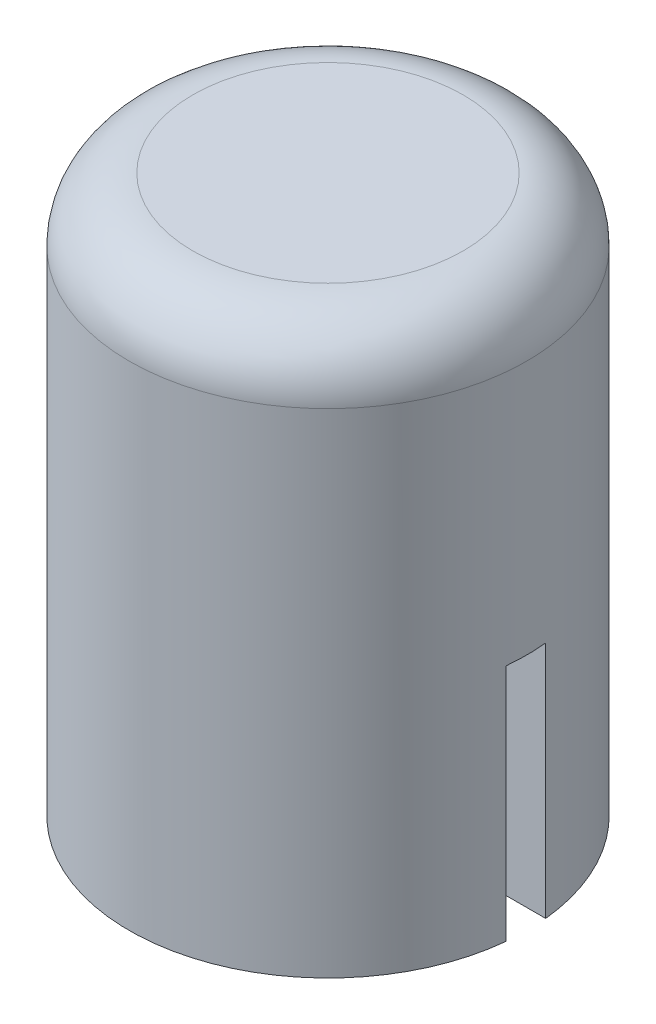
ISO-10303-21;
HEADER;
FILE_DESCRIPTION(('STEP AP214'),'2;1');
FILE_NAME('part.step','',(''),(''),'','','');
FILE_SCHEMA(('AUTOMOTIVE_DESIGN { 1 0 10303 214 1 1 1 1 }'));
ENDSEC;
DATA;
#1=APPLICATION_CONTEXT('core data for automotive mechanical design processes');
#2=APPLICATION_PROTOCOL_DEFINITION('international standard','automotive_design',2000,#1);
#3=PRODUCT_CONTEXT('',#1,'mechanical');
#4=PRODUCT('Part','Part','',(#3));
#5=PRODUCT_RELATED_PRODUCT_CATEGORY('part','',(#4));
#6=PRODUCT_DEFINITION_FORMATION('','',#4);
#7=PRODUCT_DEFINITION_CONTEXT('part definition',#1,'design');
#8=PRODUCT_DEFINITION('design','',#6,#7);
#9=PRODUCT_DEFINITION_SHAPE('','',#8);
#10=(LENGTH_UNIT() NAMED_UNIT(*) SI_UNIT(.MILLI.,.METRE.));
#11=(NAMED_UNIT(*) PLANE_ANGLE_UNIT() SI_UNIT($,.RADIAN.));
#12=(NAMED_UNIT(*) SI_UNIT($,.STERADIAN.) SOLID_ANGLE_UNIT());
#13=UNCERTAINTY_MEASURE_WITH_UNIT(LENGTH_MEASURE(1.E-05),#10,'distance_accuracy_value','');
#14=(GEOMETRIC_REPRESENTATION_CONTEXT(3) GLOBAL_UNCERTAINTY_ASSIGNED_CONTEXT((#13)) GLOBAL_UNIT_ASSIGNED_CONTEXT((#10,
#11,#12)) REPRESENTATION_CONTEXT('',''));
#15=CARTESIAN_POINT('',(0.,0.,0.));
#16=DIRECTION('',(0.,0.,1.));
#17=DIRECTION('',(1.,0.,0.));
#18=AXIS2_PLACEMENT_3D('',#15,#16,#17);
#19=CARTESIAN_POINT('',(0.,6.2,0.));
#20=DIRECTION('',(0.,1.,0.));
#21=DIRECTION('',(0.,0.,-1.));
#22=AXIS2_PLACEMENT_3D('',#19,#20,#21);
#23=TOROIDAL_SURFACE('',#22,1.7,0.8);
#24=CARTESIAN_POINT('',(0.,7.,0.));
#25=DIRECTION('',(0.,1.,0.));
#26=DIRECTION('',(0.,0.,-1.));
#27=AXIS2_PLACEMENT_3D('',#24,#25,#26);
#28=CIRCLE('',#27,1.7);
#29=CARTESIAN_POINT('',(0.,7.,-1.7));
#30=VERTEX_POINT('',#29);
#31=EDGE_CURVE('E11',#30,#30,#28,.T.);
#32=ORIENTED_EDGE('',*,*,#31,.F.);
#33=EDGE_LOOP('',(#32));
#34=FACE_BOUND('',#33,.T.);
#35=CARTESIAN_POINT('',(0.,6.2,0.));
#36=DIRECTION('',(0.,1.,0.));
#37=DIRECTION('',(0.,0.,-1.));
#38=AXIS2_PLACEMENT_3D('',#35,#36,#37);
#39=CIRCLE('',#38,2.5);
#40=CARTESIAN_POINT('',(0.,6.2,-2.5));
#41=VERTEX_POINT('',#40);
#42=EDGE_CURVE('E286',#41,#41,#39,.T.);
#43=ORIENTED_EDGE('',*,*,#42,.T.);
#44=EDGE_LOOP('',(#43));
#45=FACE_BOUND('',#44,.T.);
#46=ADVANCED_FACE('F17',(#34,#45),#23,.T.);
#47=CARTESIAN_POINT('',(0.,7.,0.));
#48=DIRECTION('',(0.,1.,0.));
#49=DIRECTION('',(1.,0.,0.));
#50=AXIS2_PLACEMENT_3D('',#47,#48,#49);
#51=PLANE('',#50);
#52=ORIENTED_EDGE('',*,*,#31,.T.);
#53=EDGE_LOOP('',(#52));
#54=FACE_BOUND('',#53,.T.);
#55=ADVANCED_FACE('F307',(#54),#51,.T.);
#56=CARTESIAN_POINT('',(-2.5,3.,-0.25));
#57=DIRECTION('',(0.,0.,-1.));
#58=DIRECTION('',(0.,-1.,0.));
#59=AXIS2_PLACEMENT_3D('',#56,#57,#58);
#60=PLANE('',#59);
#61=DIRECTION('',(1.,0.,0.));
#62=VECTOR('',#61,1.);
#63=CARTESIAN_POINT('',(1.35,3.,-0.25));
#64=LINE('',#63,#62);
#65=CARTESIAN_POINT('',(1.35,3.,-0.25));
#66=VERTEX_POINT('',#65);
#67=CARTESIAN_POINT('',(2.48746859276655,3.,-0.25));
#68=VERTEX_POINT('',#67);
#69=EDGE_CURVE('E26',#66,#68,#64,.T.);
#70=ORIENTED_EDGE('',*,*,#69,.F.);
#71=DIRECTION('',(0.,1.,0.));
#72=VECTOR('',#71,1.);
#73=CARTESIAN_POINT('',(1.35,0.,-0.25));
#74=LINE('',#73,#72);
#75=CARTESIAN_POINT('',(1.35,0.,-0.25));
#76=VERTEX_POINT('',#75);
#77=EDGE_CURVE('E154',#76,#66,#74,.T.);
#78=ORIENTED_EDGE('',*,*,#77,.F.);
#79=DIRECTION('',(1.,0.,0.));
#80=VECTOR('',#79,1.);
#81=CARTESIAN_POINT('',(1.35,0.,-0.25));
#82=LINE('',#81,#80);
#83=CARTESIAN_POINT('',(2.48746859276655,0.,-0.25));
#84=VERTEX_POINT('',#83);
#85=EDGE_CURVE('E139',#76,#84,#82,.T.);
#86=ORIENTED_EDGE('',*,*,#85,.T.);
#87=DIRECTION('',(0.,-1.,0.));
#88=VECTOR('',#87,1.);
#89=CARTESIAN_POINT('',(2.48746859276655,3.,-0.25));
#90=LINE('',#89,#88);
#91=EDGE_CURVE('E277',#68,#84,#90,.T.);
#92=ORIENTED_EDGE('',*,*,#91,.F.);
#93=EDGE_LOOP('',(#70,#78,#86,#92));
#94=FACE_BOUND('',#93,.T.);
#95=ADVANCED_FACE('F155',(#94),#60,.F.);
#96=CARTESIAN_POINT('',(0.,3.,0.));
#97=DIRECTION('',(0.,-1.,0.));
#98=DIRECTION('',(0.,0.,-1.));
#99=AXIS2_PLACEMENT_3D('',#96,#97,#98);
#100=PLANE('',#99);
#101=CARTESIAN_POINT('',(0.,3.,0.));
#102=DIRECTION('',(0.,-1.,0.));
#103=DIRECTION('',(0.99498743710662,0.,-0.1));
#104=AXIS2_PLACEMENT_3D('',#101,#102,#103);
#105=CIRCLE('',#104,2.5);
#106=CARTESIAN_POINT('',(2.48746859276655,3.,0.25));
#107=VERTEX_POINT('',#106);
#108=EDGE_CURVE('E280',#68,#107,#105,.T.);
#109=ORIENTED_EDGE('',*,*,#108,.T.);
#110=DIRECTION('',(-1.,0.,0.));
#111=VECTOR('',#110,1.);
#112=CARTESIAN_POINT('',(2.48746859276655,3.,0.25));
#113=LINE('',#112,#111);
#114=CARTESIAN_POINT('',(1.35,3.,0.25));
#115=VERTEX_POINT('',#114);
#116=EDGE_CURVE('E181',#107,#115,#113,.T.);
#117=ORIENTED_EDGE('',*,*,#116,.T.);
#118=DIRECTION('',(0.,0.,-1.));
#119=VECTOR('',#118,1.);
#120=CARTESIAN_POINT('',(1.35,3.,0.25));
#121=LINE('',#120,#119);
#122=EDGE_CURVE('E160',#115,#66,#121,.T.);
#123=ORIENTED_EDGE('',*,*,#122,.T.);
#124=ORIENTED_EDGE('',*,*,#69,.T.);
#125=EDGE_LOOP('',(#109,#117,#123,#124));
#126=FACE_BOUND('',#125,.T.);
#127=ADVANCED_FACE('F19',(#126),#100,.T.);
#128=CARTESIAN_POINT('',(-2.5,3.,0.25));
#129=DIRECTION('',(0.,0.,1.));
#130=DIRECTION('',(1.,0.,0.));
#131=AXIS2_PLACEMENT_3D('',#128,#129,#130);
#132=PLANE('',#131);
#133=DIRECTION('',(-1.,0.,0.));
#134=VECTOR('',#133,1.);
#135=CARTESIAN_POINT('',(2.48746859276655,0.,0.25));
#136=LINE('',#135,#134);
#137=CARTESIAN_POINT('',(2.48746859276655,0.,0.25));
#138=VERTEX_POINT('',#137);
#139=CARTESIAN_POINT('',(1.35,0.,0.25));
#140=VERTEX_POINT('',#139);
#141=EDGE_CURVE('E237',#138,#140,#136,.T.);
#142=ORIENTED_EDGE('',*,*,#141,.T.);
#143=DIRECTION('',(0.,-1.,0.));
#144=VECTOR('',#143,1.);
#145=CARTESIAN_POINT('',(1.35,3.,0.25));
#146=LINE('',#145,#144);
#147=EDGE_CURVE('E178',#115,#140,#146,.T.);
#148=ORIENTED_EDGE('',*,*,#147,.F.);
#149=ORIENTED_EDGE('',*,*,#116,.F.);
#150=DIRECTION('',(0.,1.,0.));
#151=VECTOR('',#150,1.);
#152=CARTESIAN_POINT('',(2.48746859276655,0.,0.25));
#153=LINE('',#152,#151);
#154=EDGE_CURVE('E254',#138,#107,#153,.T.);
#155=ORIENTED_EDGE('',*,*,#154,.F.);
#156=EDGE_LOOP('',(#142,#148,#149,#155));
#157=FACE_BOUND('',#156,.T.);
#158=ADVANCED_FACE('F345',(#157),#132,.F.);
#159=CARTESIAN_POINT('',(0.,0.,0.));
#160=DIRECTION('',(0.,1.,0.));
#161=DIRECTION('',(1.,0.,0.));
#162=AXIS2_PLACEMENT_3D('',#159,#160,#161);
#163=PLANE('',#162);
#164=DIRECTION('',(-1.,0.,0.));
#165=VECTOR('',#164,1.);
#166=CARTESIAN_POINT('',(-1.35,0.,0.25));
#167=LINE('',#166,#165);
#168=CARTESIAN_POINT('',(-1.35,0.,0.25));
#169=VERTEX_POINT('',#168);
#170=CARTESIAN_POINT('',(-2.48746859276655,0.,0.25));
#171=VERTEX_POINT('',#170);
#172=EDGE_CURVE('E235',#169,#171,#167,.T.);
#173=ORIENTED_EDGE('',*,*,#172,.F.);
#174=DIRECTION('',(0.,0.,-1.));
#175=VECTOR('',#174,1.);
#176=CARTESIAN_POINT('',(-1.35,0.,1.35));
#177=LINE('',#176,#175);
#178=CARTESIAN_POINT('',(-1.35,0.,1.35));
#179=VERTEX_POINT('',#178);
#180=EDGE_CURVE('E214',#179,#169,#177,.T.);
#181=ORIENTED_EDGE('',*,*,#180,.F.);
#182=DIRECTION('',(-1.,0.,0.));
#183=VECTOR('',#182,1.);
#184=CARTESIAN_POINT('',(1.35,0.,1.35));
#185=LINE('',#184,#183);
#186=CARTESIAN_POINT('',(1.35,0.,1.35));
#187=VERTEX_POINT('',#186);
#188=EDGE_CURVE('E151',#187,#179,#185,.T.);
#189=ORIENTED_EDGE('',*,*,#188,.F.);
#190=DIRECTION('',(0.,0.,1.));
#191=VECTOR('',#190,1.);
#192=CARTESIAN_POINT('',(1.35,0.,0.25));
#193=LINE('',#192,#191);
#194=EDGE_CURVE('E185',#140,#187,#193,.T.);
#195=ORIENTED_EDGE('',*,*,#194,.F.);
#196=ORIENTED_EDGE('',*,*,#141,.F.);
#197=CARTESIAN_POINT('',(0.,0.,0.));
#198=DIRECTION('',(0.,1.,0.));
#199=DIRECTION('',(-0.99498743710662,0.,0.1));
#200=AXIS2_PLACEMENT_3D('',#197,#198,#199);
#201=CIRCLE('',#200,2.5);
#202=EDGE_CURVE('E258',#171,#138,#201,.T.);
#203=ORIENTED_EDGE('',*,*,#202,.F.);
#204=EDGE_LOOP('',(#173,#181,#189,#195,#196,#203));
#205=FACE_BOUND('',#204,.T.);
#206=ADVANCED_FACE('F342',(#205),#163,.F.);
#207=CARTESIAN_POINT('',(-2.5,3.,0.25));
#208=DIRECTION('',(0.,0.,1.));
#209=DIRECTION('',(1.,0.,0.));
#210=AXIS2_PLACEMENT_3D('',#207,#208,#209);
#211=PLANE('',#210);
#212=DIRECTION('',(-1.,0.,0.));
#213=VECTOR('',#212,1.);
#214=CARTESIAN_POINT('',(-1.35,3.,0.25));
#215=LINE('',#214,#213);
#216=CARTESIAN_POINT('',(-1.35,3.,0.25));
#217=VERTEX_POINT('',#216);
#218=CARTESIAN_POINT('',(-2.48746859276655,3.,0.25));
#219=VERTEX_POINT('',#218);
#220=EDGE_CURVE('E232',#217,#219,#215,.T.);
#221=ORIENTED_EDGE('',*,*,#220,.F.);
#222=DIRECTION('',(0.,1.,0.));
#223=VECTOR('',#222,1.);
#224=CARTESIAN_POINT('',(-1.35,0.,0.25));
#225=LINE('',#224,#223);
#226=EDGE_CURVE('E218',#169,#217,#225,.T.);
#227=ORIENTED_EDGE('',*,*,#226,.F.);
#228=ORIENTED_EDGE('',*,*,#172,.T.);
#229=DIRECTION('',(0.,-1.,0.));
#230=VECTOR('',#229,1.);
#231=CARTESIAN_POINT('',(-2.48746859276655,3.,0.25));
#232=LINE('',#231,#230);
#233=EDGE_CURVE('E262',#219,#171,#232,.T.);
#234=ORIENTED_EDGE('',*,*,#233,.F.);
#235=EDGE_LOOP('',(#221,#227,#228,#234));
#236=FACE_BOUND('',#235,.T.);
#237=ADVANCED_FACE('F341',(#236),#211,.F.);
#238=CARTESIAN_POINT('',(0.,3.,0.));
#239=DIRECTION('',(0.,-1.,0.));
#240=DIRECTION('',(0.,0.,-1.));
#241=AXIS2_PLACEMENT_3D('',#238,#239,#240);
#242=PLANE('',#241);
#243=CARTESIAN_POINT('',(0.,3.,0.));
#244=DIRECTION('',(0.,-1.,0.));
#245=DIRECTION('',(-0.99498743710662,0.,0.1));
#246=AXIS2_PLACEMENT_3D('',#243,#244,#245);
#247=CIRCLE('',#246,2.5);
#248=CARTESIAN_POINT('',(-2.48746859276655,3.,-0.25));
#249=VERTEX_POINT('',#248);
#250=EDGE_CURVE('E266',#219,#249,#247,.T.);
#251=ORIENTED_EDGE('',*,*,#250,.T.);
#252=DIRECTION('',(1.,0.,0.));
#253=VECTOR('',#252,1.);
#254=CARTESIAN_POINT('',(-2.48746859276655,3.,-0.25));
#255=LINE('',#254,#253);
#256=CARTESIAN_POINT('',(-1.35,3.,-0.25));
#257=VERTEX_POINT('',#256);
#258=EDGE_CURVE('E48',#249,#257,#255,.T.);
#259=ORIENTED_EDGE('',*,*,#258,.T.);
#260=DIRECTION('',(0.,0.,1.));
#261=VECTOR('',#260,1.);
#262=CARTESIAN_POINT('',(-1.35,3.,-0.25));
#263=LINE('',#262,#261);
#264=EDGE_CURVE('E199',#257,#217,#263,.T.);
#265=ORIENTED_EDGE('',*,*,#264,.T.);
#266=ORIENTED_EDGE('',*,*,#220,.T.);
#267=EDGE_LOOP('',(#251,#259,#265,#266));
#268=FACE_BOUND('',#267,.T.);
#269=ADVANCED_FACE('F333',(#268),#242,.T.);
#270=CARTESIAN_POINT('',(-2.5,3.,-0.25));
#271=DIRECTION('',(0.,0.,-1.));
#272=DIRECTION('',(0.,-1.,0.));
#273=AXIS2_PLACEMENT_3D('',#270,#271,#272);
#274=PLANE('',#273);
#275=DIRECTION('',(1.,0.,0.));
#276=VECTOR('',#275,1.);
#277=CARTESIAN_POINT('',(-2.48746859276655,0.,-0.25));
#278=LINE('',#277,#276);
#279=CARTESIAN_POINT('',(-2.48746859276655,0.,-0.25));
#280=VERTEX_POINT('',#279);
#281=CARTESIAN_POINT('',(-1.35,0.,-0.25));
#282=VERTEX_POINT('',#281);
#283=EDGE_CURVE('E38',#280,#282,#278,.T.);
#284=ORIENTED_EDGE('',*,*,#283,.T.);
#285=DIRECTION('',(0.,-1.,0.));
#286=VECTOR('',#285,1.);
#287=CARTESIAN_POINT('',(-1.35,3.,-0.25));
#288=LINE('',#287,#286);
#289=EDGE_CURVE('E194',#257,#282,#288,.T.);
#290=ORIENTED_EDGE('',*,*,#289,.F.);
#291=ORIENTED_EDGE('',*,*,#258,.F.);
#292=DIRECTION('',(0.,1.,0.));
#293=VECTOR('',#292,1.);
#294=CARTESIAN_POINT('',(-2.48746859276655,0.,-0.25));
#295=LINE('',#294,#293);
#296=EDGE_CURVE('E269',#280,#249,#295,.T.);
#297=ORIENTED_EDGE('',*,*,#296,.F.);
#298=EDGE_LOOP('',(#284,#290,#291,#297));
#299=FACE_BOUND('',#298,.T.);
#300=ADVANCED_FACE('F330',(#299),#274,.F.);
#301=CARTESIAN_POINT('',(0.,0.,0.));
#302=DIRECTION('',(0.,1.,0.));
#303=DIRECTION('',(1.,0.,0.));
#304=AXIS2_PLACEMENT_3D('',#301,#302,#303);
#305=PLANE('',#304);
#306=CARTESIAN_POINT('',(0.,0.,0.));
#307=DIRECTION('',(0.,1.,0.));
#308=DIRECTION('',(0.99498743710662,0.,-0.1));
#309=AXIS2_PLACEMENT_3D('',#306,#307,#308);
#310=CIRCLE('',#309,2.5);
#311=EDGE_CURVE('E146',#84,#280,#310,.T.);
#312=ORIENTED_EDGE('',*,*,#311,.F.);
#313=ORIENTED_EDGE('',*,*,#85,.F.);
#314=DIRECTION('',(0.,0.,1.));
#315=VECTOR('',#314,1.);
#316=CARTESIAN_POINT('',(1.35,0.,-1.35));
#317=LINE('',#316,#315);
#318=CARTESIAN_POINT('',(1.35,0.,-1.35));
#319=VERTEX_POINT('',#318);
#320=EDGE_CURVE('E144',#319,#76,#317,.T.);
#321=ORIENTED_EDGE('',*,*,#320,.F.);
#322=DIRECTION('',(1.,0.,0.));
#323=VECTOR('',#322,1.);
#324=CARTESIAN_POINT('',(-1.35,0.,-1.35));
#325=LINE('',#324,#323);
#326=CARTESIAN_POINT('',(-1.35,0.,-1.35));
#327=VERTEX_POINT('',#326);
#328=EDGE_CURVE('E206',#327,#319,#325,.T.);
#329=ORIENTED_EDGE('',*,*,#328,.F.);
#330=DIRECTION('',(0.,0.,-1.));
#331=VECTOR('',#330,1.);
#332=CARTESIAN_POINT('',(-1.35,0.,-0.25));
#333=LINE('',#332,#331);
#334=EDGE_CURVE('E198',#282,#327,#333,.T.);
#335=ORIENTED_EDGE('',*,*,#334,.F.);
#336=ORIENTED_EDGE('',*,*,#283,.F.);
#337=EDGE_LOOP('',(#312,#313,#321,#329,#335,#336));
#338=FACE_BOUND('',#337,.T.);
#339=ADVANCED_FACE('F141',(#338),#305,.F.);
#340=CARTESIAN_POINT('',(0.,6.,0.));
#341=DIRECTION('',(0.,1.,0.));
#342=DIRECTION('',(1.,0.,0.));
#343=AXIS2_PLACEMENT_3D('',#340,#341,#342);
#344=PLANE('',#343);
#345=DIRECTION('',(-1.,0.,0.));
#346=VECTOR('',#345,1.);
#347=CARTESIAN_POINT('',(1.35,6.,1.35));
#348=LINE('',#347,#346);
#349=CARTESIAN_POINT('',(1.35,6.,1.35));
#350=VERTEX_POINT('',#349);
#351=CARTESIAN_POINT('',(-1.35,6.,1.35));
#352=VERTEX_POINT('',#351);
#353=EDGE_CURVE('E223',#350,#352,#348,.T.);
#354=ORIENTED_EDGE('',*,*,#353,.T.);
#355=DIRECTION('',(0.,0.,-1.));
#356=VECTOR('',#355,1.);
#357=CARTESIAN_POINT('',(-1.35,6.,1.35));
#358=LINE('',#357,#356);
#359=CARTESIAN_POINT('',(-1.35,6.,-1.35));
#360=VERTEX_POINT('',#359);
#361=EDGE_CURVE('E209',#352,#360,#358,.T.);
#362=ORIENTED_EDGE('',*,*,#361,.T.);
#363=DIRECTION('',(1.,0.,0.));
#364=VECTOR('',#363,1.);
#365=CARTESIAN_POINT('',(-1.35,6.,-1.35));
#366=LINE('',#365,#364);
#367=CARTESIAN_POINT('',(1.35,6.,-1.35));
#368=VERTEX_POINT('',#367);
#369=EDGE_CURVE('E193',#360,#368,#366,.T.);
#370=ORIENTED_EDGE('',*,*,#369,.T.);
#371=DIRECTION('',(0.,0.,1.));
#372=VECTOR('',#371,1.);
#373=CARTESIAN_POINT('',(1.35,6.,-1.35));
#374=LINE('',#373,#372);
#375=EDGE_CURVE('E172',#368,#350,#374,.T.);
#376=ORIENTED_EDGE('',*,*,#375,.T.);
#377=EDGE_LOOP('',(#354,#362,#370,#376));
#378=FACE_BOUND('',#377,.T.);
#379=ADVANCED_FACE('F328',(#378),#344,.F.);
#380=CARTESIAN_POINT('',(-1.35,7.,1.35));
#381=DIRECTION('',(0.,0.,1.));
#382=DIRECTION('',(1.,0.,0.));
#383=AXIS2_PLACEMENT_3D('',#380,#381,#382);
#384=PLANE('',#383);
#385=ORIENTED_EDGE('',*,*,#353,.F.);
#386=DIRECTION('',(0.,-1.,0.));
#387=VECTOR('',#386,1.);
#388=CARTESIAN_POINT('',(1.35,6.,1.35));
#389=LINE('',#388,#387);
#390=EDGE_CURVE('E189',#350,#187,#389,.T.);
#391=ORIENTED_EDGE('',*,*,#390,.T.);
#392=ORIENTED_EDGE('',*,*,#188,.T.);
#393=DIRECTION('',(0.,-1.,0.));
#394=VECTOR('',#393,1.);
#395=CARTESIAN_POINT('',(-1.35,6.,1.35));
#396=LINE('',#395,#394);
#397=EDGE_CURVE('E210',#352,#179,#396,.T.);
#398=ORIENTED_EDGE('',*,*,#397,.F.);
#399=EDGE_LOOP('',(#385,#391,#392,#398));
#400=FACE_BOUND('',#399,.T.);
#401=ADVANCED_FACE('F324',(#400),#384,.F.);
#402=CARTESIAN_POINT('',(-1.35,7.,1.35));
#403=DIRECTION('',(-1.,0.,0.));
#404=DIRECTION('',(0.,0.,1.));
#405=AXIS2_PLACEMENT_3D('',#402,#403,#404);
#406=PLANE('',#405);
#407=ORIENTED_EDGE('',*,*,#361,.F.);
#408=ORIENTED_EDGE('',*,*,#397,.T.);
#409=ORIENTED_EDGE('',*,*,#180,.T.);
#410=ORIENTED_EDGE('',*,*,#226,.T.);
#411=ORIENTED_EDGE('',*,*,#264,.F.);
#412=ORIENTED_EDGE('',*,*,#289,.T.);
#413=ORIENTED_EDGE('',*,*,#334,.T.);
#414=DIRECTION('',(0.,-1.,0.));
#415=VECTOR('',#414,1.);
#416=CARTESIAN_POINT('',(-1.35,6.,-1.35));
#417=LINE('',#416,#415);
#418=EDGE_CURVE('E202',#360,#327,#417,.T.);
#419=ORIENTED_EDGE('',*,*,#418,.F.);
#420=EDGE_LOOP('',(#407,#408,#409,#410,#411,#412,#413,#419));
#421=FACE_BOUND('',#420,.T.);
#422=ADVANCED_FACE('F320',(#421),#406,.F.);
#423=CARTESIAN_POINT('',(-1.35,7.,-1.35));
#424=DIRECTION('',(0.,0.,-1.));
#425=DIRECTION('',(0.,-1.,0.));
#426=AXIS2_PLACEMENT_3D('',#423,#424,#425);
#427=PLANE('',#426);
#428=ORIENTED_EDGE('',*,*,#369,.F.);
#429=ORIENTED_EDGE('',*,*,#418,.T.);
#430=ORIENTED_EDGE('',*,*,#328,.T.);
#431=DIRECTION('',(0.,-1.,0.));
#432=VECTOR('',#431,1.);
#433=CARTESIAN_POINT('',(1.35,6.,-1.35));
#434=LINE('',#433,#432);
#435=EDGE_CURVE('E165',#368,#319,#434,.T.);
#436=ORIENTED_EDGE('',*,*,#435,.F.);
#437=EDGE_LOOP('',(#428,#429,#430,#436));
#438=FACE_BOUND('',#437,.T.);
#439=ADVANCED_FACE('F302',(#438),#427,.F.);
#440=CARTESIAN_POINT('',(1.35,7.,1.35));
#441=DIRECTION('',(1.,0.,0.));
#442=DIRECTION('',(0.,0.,1.));
#443=AXIS2_PLACEMENT_3D('',#440,#441,#442);
#444=PLANE('',#443);
#445=ORIENTED_EDGE('',*,*,#375,.F.);
#446=ORIENTED_EDGE('',*,*,#435,.T.);
#447=ORIENTED_EDGE('',*,*,#320,.T.);
#448=ORIENTED_EDGE('',*,*,#77,.T.);
#449=ORIENTED_EDGE('',*,*,#122,.F.);
#450=ORIENTED_EDGE('',*,*,#147,.T.);
#451=ORIENTED_EDGE('',*,*,#194,.T.);
#452=ORIENTED_EDGE('',*,*,#390,.F.);
#453=EDGE_LOOP('',(#445,#446,#447,#448,#449,#450,#451,#452));
#454=FACE_BOUND('',#453,.T.);
#455=ADVANCED_FACE('F163',(#454),#444,.F.);
#456=CARTESIAN_POINT('',(0.,9.,0.));
#457=DIRECTION('',(0.,-1.,0.));
#458=DIRECTION('',(0.,0.,-1.));
#459=AXIS2_PLACEMENT_3D('',#456,#457,#458);
#460=CYLINDRICAL_SURFACE('',#459,2.5);
#461=ORIENTED_EDGE('',*,*,#108,.F.);
#462=ORIENTED_EDGE('',*,*,#91,.T.);
#463=ORIENTED_EDGE('',*,*,#311,.T.);
#464=ORIENTED_EDGE('',*,*,#296,.T.);
#465=ORIENTED_EDGE('',*,*,#250,.F.);
#466=ORIENTED_EDGE('',*,*,#233,.T.);
#467=ORIENTED_EDGE('',*,*,#202,.T.);
#468=ORIENTED_EDGE('',*,*,#154,.T.);
#469=EDGE_LOOP('',(#461,#462,#463,#464,#465,#466,#467,#468));
#470=FACE_BOUND('',#469,.T.);
#471=ORIENTED_EDGE('',*,*,#42,.F.);
#472=EDGE_LOOP('',(#471));
#473=FACE_BOUND('',#472,.T.);
#474=ADVANCED_FACE('F294',(#470,#473),#460,.T.);
#475=CLOSED_SHELL('',(#46,#55,#95,#127,#158,#206,#237,#269,#300,#339,#379,#401,#422,#439,#455,#474));
#476=MANIFOLD_SOLID_BREP('B1',#475);
#477=ADVANCED_BREP_SHAPE_REPRESENTATION('',(#18,#476),#14);
#478=SHAPE_DEFINITION_REPRESENTATION(#9,#477);
ENDSEC;
END-ISO-10303-21;
